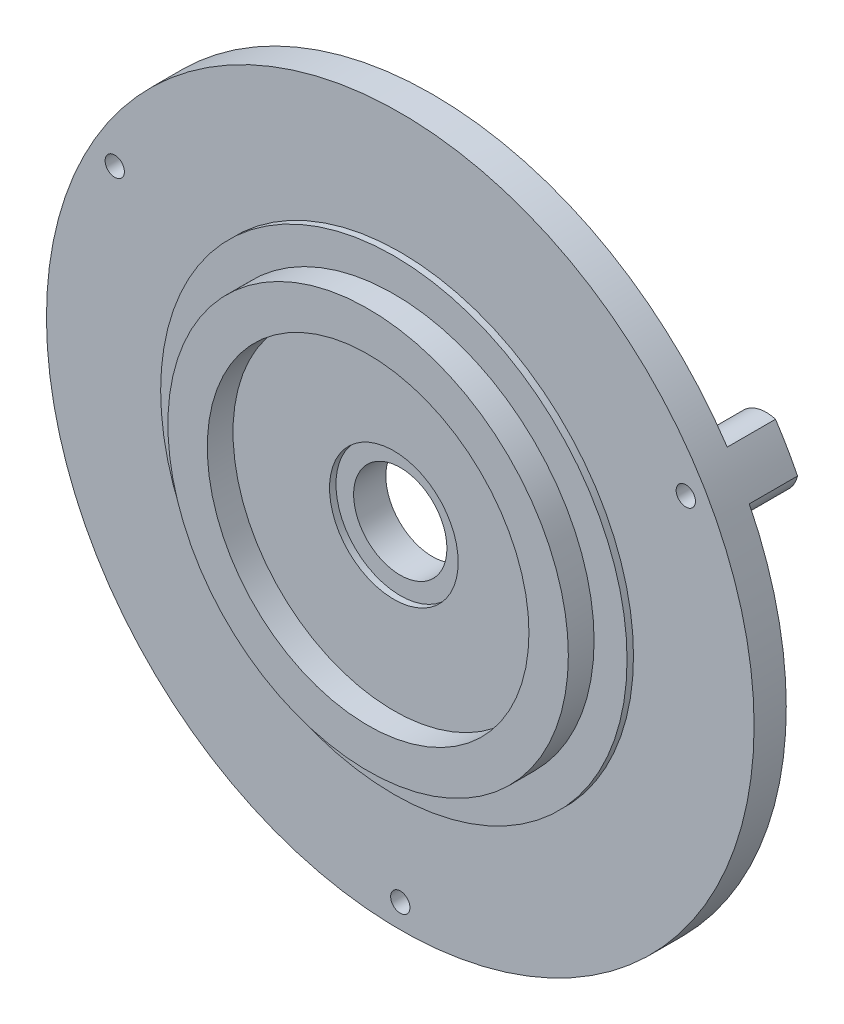
ISO-10303-21;
HEADER;
FILE_DESCRIPTION(('STEP AP214'),'2;1');
FILE_NAME('part.step','',(''),(''),'','','');
FILE_SCHEMA(('AUTOMOTIVE_DESIGN { 1 0 10303 214 1 1 1 1 }'));
ENDSEC;
DATA;
#1=APPLICATION_CONTEXT('core data for automotive mechanical design processes');
#2=APPLICATION_PROTOCOL_DEFINITION('international standard','automotive_design',2000,#1);
#3=PRODUCT_CONTEXT('',#1,'mechanical');
#4=PRODUCT('Part','Part','',(#3));
#5=PRODUCT_RELATED_PRODUCT_CATEGORY('part','',(#4));
#6=PRODUCT_DEFINITION_FORMATION('','',#4);
#7=PRODUCT_DEFINITION_CONTEXT('part definition',#1,'design');
#8=PRODUCT_DEFINITION('design','',#6,#7);
#9=PRODUCT_DEFINITION_SHAPE('','',#8);
#10=(LENGTH_UNIT() NAMED_UNIT(*) SI_UNIT(.MILLI.,.METRE.));
#11=(NAMED_UNIT(*) PLANE_ANGLE_UNIT() SI_UNIT($,.RADIAN.));
#12=(NAMED_UNIT(*) SI_UNIT($,.STERADIAN.) SOLID_ANGLE_UNIT());
#13=UNCERTAINTY_MEASURE_WITH_UNIT(LENGTH_MEASURE(1.E-05),#10,'distance_accuracy_value','');
#14=(GEOMETRIC_REPRESENTATION_CONTEXT(3) GLOBAL_UNCERTAINTY_ASSIGNED_CONTEXT((#13)) GLOBAL_UNIT_ASSIGNED_CONTEXT((#10,
#11,#12)) REPRESENTATION_CONTEXT('',''));
#15=CARTESIAN_POINT('',(0.,0.,0.));
#16=DIRECTION('',(0.,0.,1.));
#17=DIRECTION('',(1.,0.,0.));
#18=AXIS2_PLACEMENT_3D('',#15,#16,#17);
#19=CARTESIAN_POINT('',(0.,0.,2.));
#20=DIRECTION('',(0.,0.,1.));
#21=DIRECTION('',(1.,0.,0.));
#22=AXIS2_PLACEMENT_3D('',#19,#20,#21);
#23=PLANE('',#22);
#24=CARTESIAN_POINT('',(0.,0.,2.));
#25=DIRECTION('',(0.,0.,1.));
#26=DIRECTION('',(1.,0.,0.));
#27=AXIS2_PLACEMENT_3D('',#24,#25,#26);
#28=CIRCLE('',#27,2.9);
#29=CARTESIAN_POINT('',(2.9,0.,2.));
#30=VERTEX_POINT('',#29);
#31=EDGE_CURVE('E151',#30,#30,#28,.T.);
#32=ORIENTED_EDGE('',*,*,#31,.F.);
#33=EDGE_LOOP('',(#32));
#34=FACE_BOUND('',#33,.T.);
#35=CARTESIAN_POINT('',(0.,0.,2.));
#36=DIRECTION('',(0.,0.,1.));
#37=DIRECTION('',(1.,0.,0.));
#38=AXIS2_PLACEMENT_3D('',#35,#36,#37);
#39=CIRCLE('',#38,4.);
#40=CARTESIAN_POINT('',(4.,0.,2.));
#41=VERTEX_POINT('',#40);
#42=EDGE_CURVE('E48',#41,#41,#39,.F.);
#43=ORIENTED_EDGE('',*,*,#42,.F.);
#44=EDGE_LOOP('',(#43));
#45=FACE_BOUND('',#44,.T.);
#46=ADVANCED_FACE('F39',(#34,#45),#23,.T.);
#47=CARTESIAN_POINT('',(0.,0.,2.));
#48=DIRECTION('',(0.,0.,-1.));
#49=DIRECTION('',(-1.,0.,0.));
#50=AXIS2_PLACEMENT_3D('',#47,#48,#49);
#51=CYLINDRICAL_SURFACE('',#50,22.);
#52=CARTESIAN_POINT('',(0.,0.,2.));
#53=DIRECTION('',(0.,0.,1.));
#54=DIRECTION('',(1.,0.,0.));
#55=AXIS2_PLACEMENT_3D('',#52,#53,#54);
#56=CIRCLE('',#55,22.);
#57=CARTESIAN_POINT('',(22.,0.,2.));
#58=VERTEX_POINT('',#57);
#59=EDGE_CURVE('E165',#58,#58,#56,.T.);
#60=ORIENTED_EDGE('',*,*,#59,.F.);
#61=EDGE_LOOP('',(#60));
#62=FACE_BOUND('',#61,.T.);
#63=CARTESIAN_POINT('',(0.,0.,0.));
#64=DIRECTION('',(0.,0.,1.));
#65=DIRECTION('',(1.,0.,0.));
#66=AXIS2_PLACEMENT_3D('',#63,#64,#65);
#67=CIRCLE('',#66,22.);
#68=CARTESIAN_POINT('',(-19.7004715536397,9.79241648237204,0.));
#69=VERTEX_POINT('',#68);
#70=CARTESIAN_POINT('',(-1.36975433864802,-21.9573170731707,0.));
#71=VERTEX_POINT('',#70);
#72=EDGE_CURVE('E169',#69,#71,#67,.T.);
#73=ORIENTED_EDGE('',*,*,#72,.T.);
#74=DIRECTION('',(0.,0.,1.));
#75=VECTOR('',#74,1.);
#76=CARTESIAN_POINT('',(-1.36975433864802,-21.9573170731707,-3.));
#77=LINE('',#76,#75);
#78=CARTESIAN_POINT('',(-1.36975433864802,-21.9573170731707,-3.));
#79=VERTEX_POINT('',#78);
#80=EDGE_CURVE('E128',#79,#71,#77,.T.);
#81=ORIENTED_EDGE('',*,*,#80,.F.);
#82=CARTESIAN_POINT('',(0.,0.,-3.));
#83=DIRECTION('',(0.,0.,-1.));
#84=DIRECTION('',(-1.,0.,0.));
#85=AXIS2_PLACEMENT_3D('',#82,#83,#84);
#86=CIRCLE('',#85,22.);
#87=CARTESIAN_POINT('',(1.36975433864802,-21.9573170731707,-3.));
#88=VERTEX_POINT('',#87);
#89=EDGE_CURVE('E114',#88,#79,#86,.T.);
#90=ORIENTED_EDGE('',*,*,#89,.F.);
#91=DIRECTION('',(0.,0.,1.));
#92=VECTOR('',#91,1.);
#93=CARTESIAN_POINT('',(1.36975433864802,-21.9573170731707,-3.));
#94=LINE('',#93,#92);
#95=CARTESIAN_POINT('',(1.36975433864802,-21.9573170731707,0.));
#96=VERTEX_POINT('',#95);
#97=EDGE_CURVE('E124',#88,#96,#94,.T.);
#98=ORIENTED_EDGE('',*,*,#97,.T.);
#99=CARTESIAN_POINT('',(19.7004715536396,9.79241648237232,0.));
#100=VERTEX_POINT('',#99);
#101=EDGE_CURVE('E109',#96,#100,#67,.T.);
#102=ORIENTED_EDGE('',*,*,#101,.T.);
#103=DIRECTION('',(0.,0.,1.));
#104=VECTOR('',#103,1.);
#105=CARTESIAN_POINT('',(19.7004715536396,9.79241648237232,-3.));
#106=LINE('',#105,#104);
#107=CARTESIAN_POINT('',(19.7004715536396,9.79241648237232,-3.));
#108=VERTEX_POINT('',#107);
#109=EDGE_CURVE('E96',#108,#100,#106,.T.);
#110=ORIENTED_EDGE('',*,*,#109,.F.);
#111=CARTESIAN_POINT('',(0.,0.,-3.));
#112=DIRECTION('',(0.,0.,-1.));
#113=DIRECTION('',(-1.,0.,0.));
#114=AXIS2_PLACEMENT_3D('',#111,#112,#113);
#115=CIRCLE('',#114,22.);
#116=CARTESIAN_POINT('',(18.3307172149916,12.1649005907986,-3.));
#117=VERTEX_POINT('',#116);
#118=EDGE_CURVE('E102',#117,#108,#115,.T.);
#119=ORIENTED_EDGE('',*,*,#118,.F.);
#120=DIRECTION('',(0.,0.,1.));
#121=VECTOR('',#120,1.);
#122=CARTESIAN_POINT('',(18.3307172149916,12.1649005907986,-3.));
#123=LINE('',#122,#121);
#124=CARTESIAN_POINT('',(18.3307172149916,12.1649005907986,0.));
#125=VERTEX_POINT('',#124);
#126=EDGE_CURVE('E98',#117,#125,#123,.T.);
#127=ORIENTED_EDGE('',*,*,#126,.T.);
#128=CARTESIAN_POINT('',(-18.3307172149917,12.1649005907983,0.));
#129=VERTEX_POINT('',#128);
#130=EDGE_CURVE('E164',#125,#129,#67,.T.);
#131=ORIENTED_EDGE('',*,*,#130,.T.);
#132=DIRECTION('',(0.,0.,1.));
#133=VECTOR('',#132,1.);
#134=CARTESIAN_POINT('',(-18.3307172149917,12.1649005907983,-3.));
#135=LINE('',#134,#133);
#136=CARTESIAN_POINT('',(-18.3307172149917,12.1649005907983,-3.));
#137=VERTEX_POINT('',#136);
#138=EDGE_CURVE('E147',#137,#129,#135,.T.);
#139=ORIENTED_EDGE('',*,*,#138,.F.);
#140=CARTESIAN_POINT('',(0.,0.,-3.));
#141=DIRECTION('',(0.,0.,-1.));
#142=DIRECTION('',(-1.,0.,0.));
#143=AXIS2_PLACEMENT_3D('',#140,#141,#142);
#144=CIRCLE('',#143,22.);
#145=CARTESIAN_POINT('',(-19.7004715536397,9.79241648237204,-3.));
#146=VERTEX_POINT('',#145);
#147=EDGE_CURVE('E133',#146,#137,#144,.T.);
#148=ORIENTED_EDGE('',*,*,#147,.F.);
#149=DIRECTION('',(0.,0.,1.));
#150=VECTOR('',#149,1.);
#151=CARTESIAN_POINT('',(-19.7004715536397,9.79241648237204,-3.));
#152=LINE('',#151,#150);
#153=EDGE_CURVE('E140',#146,#69,#152,.T.);
#154=ORIENTED_EDGE('',*,*,#153,.T.);
#155=EDGE_LOOP('',(#73,#81,#90,#98,#102,#110,#119,#127,#131,#139,#148,#154));
#156=FACE_BOUND('',#155,.T.);
#157=ADVANCED_FACE('F41',(#62,#156),#51,.T.);
#158=CARTESIAN_POINT('',(0.,0.,2.));
#159=DIRECTION('',(0.,0.,1.));
#160=DIRECTION('',(1.,0.,0.));
#161=AXIS2_PLACEMENT_3D('',#158,#159,#160);
#162=CIRCLE('',#161,14.5);
#163=CARTESIAN_POINT('',(14.5,0.,2.));
#164=VERTEX_POINT('',#163);
#165=EDGE_CURVE('E200',#164,#164,#162,.T.);
#166=ORIENTED_EDGE('',*,*,#165,.F.);
#167=EDGE_LOOP('',(#166));
#168=FACE_BOUND('',#167,.T.);
#169=CARTESIAN_POINT('',(0.,-20.5,2.));
#170=DIRECTION('',(0.,0.,1.));
#171=DIRECTION('',(1.,0.,0.));
#172=AXIS2_PLACEMENT_3D('',#169,#170,#171);
#173=CIRCLE('',#172,0.6);
#174=CARTESIAN_POINT('',(0.6,-20.5,2.));
#175=VERTEX_POINT('',#174);
#176=EDGE_CURVE('E204',#175,#175,#173,.T.);
#177=ORIENTED_EDGE('',*,*,#176,.F.);
#178=EDGE_LOOP('',(#177));
#179=FACE_BOUND('',#178,.T.);
#180=CARTESIAN_POINT('',(17.7535207775809,10.2500000000001,2.));
#181=DIRECTION('',(0.,0.,1.));
#182=DIRECTION('',(1.,0.,0.));
#183=AXIS2_PLACEMENT_3D('',#180,#181,#182);
#184=CIRCLE('',#183,0.6);
#185=CARTESIAN_POINT('',(18.353520777581,10.2500000000001,2.));
#186=VERTEX_POINT('',#185);
#187=EDGE_CURVE('E208',#186,#186,#184,.T.);
#188=ORIENTED_EDGE('',*,*,#187,.F.);
#189=EDGE_LOOP('',(#188));
#190=FACE_BOUND('',#189,.T.);
#191=CARTESIAN_POINT('',(-17.7535207775811,10.2499999999998,2.));
#192=DIRECTION('',(0.,0.,1.));
#193=DIRECTION('',(1.,0.,0.));
#194=AXIS2_PLACEMENT_3D('',#191,#192,#193);
#195=CIRCLE('',#194,0.6);
#196=CARTESIAN_POINT('',(-17.1535207775811,10.2499999999998,2.));
#197=VERTEX_POINT('',#196);
#198=EDGE_CURVE('E212',#197,#197,#195,.T.);
#199=ORIENTED_EDGE('',*,*,#198,.F.);
#200=EDGE_LOOP('',(#199));
#201=FACE_BOUND('',#200,.T.);
#202=ORIENTED_EDGE('',*,*,#59,.T.);
#203=EDGE_LOOP('',(#202));
#204=FACE_BOUND('',#203,.T.);
#205=ADVANCED_FACE('F183',(#168,#179,#190,#201,#204),#23,.T.);
#206=CARTESIAN_POINT('',(0.,0.,0.));
#207=DIRECTION('',(0.,0.,1.));
#208=DIRECTION('',(1.,0.,0.));
#209=AXIS2_PLACEMENT_3D('',#206,#207,#208);
#210=PLANE('',#209);
#211=CARTESIAN_POINT('',(17.7535207775809,10.2500000000001,0.));
#212=DIRECTION('',(0.,0.,-1.));
#213=DIRECTION('',(-1.,0.,0.));
#214=AXIS2_PLACEMENT_3D('',#211,#212,#213);
#215=CIRCLE('',#214,1.99999999999999);
#216=EDGE_CURVE('E55',#100,#125,#215,.T.);
#217=ORIENTED_EDGE('',*,*,#216,.F.);
#218=ORIENTED_EDGE('',*,*,#101,.F.);
#219=CARTESIAN_POINT('',(0.,-20.5,0.));
#220=DIRECTION('',(0.,0.,-1.));
#221=DIRECTION('',(-1.,0.,0.));
#222=AXIS2_PLACEMENT_3D('',#219,#220,#221);
#223=CIRCLE('',#222,2.);
#224=EDGE_CURVE('E61',#71,#96,#223,.T.);
#225=ORIENTED_EDGE('',*,*,#224,.F.);
#226=ORIENTED_EDGE('',*,*,#72,.F.);
#227=CARTESIAN_POINT('',(-17.7535207775811,10.2499999999998,0.));
#228=DIRECTION('',(0.,0.,-1.));
#229=DIRECTION('',(-1.,0.,0.));
#230=AXIS2_PLACEMENT_3D('',#227,#228,#229);
#231=CIRCLE('',#230,2.);
#232=EDGE_CURVE('E132',#129,#69,#231,.T.);
#233=ORIENTED_EDGE('',*,*,#232,.F.);
#234=ORIENTED_EDGE('',*,*,#130,.F.);
#235=EDGE_LOOP('',(#217,#218,#225,#226,#233,#234));
#236=FACE_BOUND('',#235,.T.);
#237=CARTESIAN_POINT('',(0.,0.,0.));
#238=DIRECTION('',(0.,0.,1.));
#239=DIRECTION('',(1.,0.,0.));
#240=AXIS2_PLACEMENT_3D('',#237,#238,#239);
#241=CIRCLE('',#240,2.9);
#242=CARTESIAN_POINT('',(2.9,0.,0.));
#243=VERTEX_POINT('',#242);
#244=EDGE_CURVE('E155',#243,#243,#241,.T.);
#245=ORIENTED_EDGE('',*,*,#244,.T.);
#246=EDGE_LOOP('',(#245));
#247=FACE_BOUND('',#246,.T.);
#248=ADVANCED_FACE('F191',(#236,#247),#210,.F.);
#249=CARTESIAN_POINT('',(0.,0.,-9.));
#250=DIRECTION('',(0.,0.,1.));
#251=DIRECTION('',(1.,0.,0.));
#252=AXIS2_PLACEMENT_3D('',#249,#250,#251);
#253=CYLINDRICAL_SURFACE('',#252,2.9);
#254=ORIENTED_EDGE('',*,*,#31,.T.);
#255=EDGE_LOOP('',(#254));
#256=FACE_BOUND('',#255,.T.);
#257=ORIENTED_EDGE('',*,*,#244,.F.);
#258=EDGE_LOOP('',(#257));
#259=FACE_BOUND('',#258,.T.);
#260=ADVANCED_FACE('F196',(#256,#259),#253,.F.);
#261=CARTESIAN_POINT('',(-17.7535207775811,10.2499999999998,-3.));
#262=DIRECTION('',(0.,0.,1.));
#263=DIRECTION('',(1.,0.,0.));
#264=AXIS2_PLACEMENT_3D('',#261,#262,#263);
#265=CYLINDRICAL_SURFACE('',#264,2.);
#266=ORIENTED_EDGE('',*,*,#232,.T.);
#267=ORIENTED_EDGE('',*,*,#153,.F.);
#268=CARTESIAN_POINT('',(-17.7535207775811,10.2499999999998,-3.));
#269=DIRECTION('',(0.,0.,-1.));
#270=DIRECTION('',(-1.,0.,0.));
#271=AXIS2_PLACEMENT_3D('',#268,#269,#270);
#272=CIRCLE('',#271,2.);
#273=EDGE_CURVE('E137',#137,#146,#272,.T.);
#274=ORIENTED_EDGE('',*,*,#273,.F.);
#275=ORIENTED_EDGE('',*,*,#138,.T.);
#276=EDGE_LOOP('',(#266,#267,#274,#275));
#277=FACE_BOUND('',#276,.T.);
#278=ADVANCED_FACE('F276',(#277),#265,.T.);
#279=CARTESIAN_POINT('',(-8.87676038879054,5.12499999999992,-3.));
#280=DIRECTION('',(0.,0.,-1.));
#281=DIRECTION('',(-1.,0.,0.));
#282=AXIS2_PLACEMENT_3D('',#279,#280,#281);
#283=PLANE('',#282);
#284=CARTESIAN_POINT('',(-17.7535207775811,10.2499999999998,-3.));
#285=DIRECTION('',(0.,0.,-1.));
#286=DIRECTION('',(-1.,0.,0.));
#287=AXIS2_PLACEMENT_3D('',#284,#285,#286);
#288=CIRCLE('',#287,0.6);
#289=CARTESIAN_POINT('',(-18.3535207775811,10.2499999999998,-3.));
#290=VERTEX_POINT('',#289);
#291=EDGE_CURVE('E224',#290,#290,#288,.T.);
#292=ORIENTED_EDGE('',*,*,#291,.F.);
#293=EDGE_LOOP('',(#292));
#294=FACE_BOUND('',#293,.T.);
#295=ORIENTED_EDGE('',*,*,#147,.T.);
#296=ORIENTED_EDGE('',*,*,#273,.T.);
#297=EDGE_LOOP('',(#295,#296));
#298=FACE_BOUND('',#297,.T.);
#299=ADVANCED_FACE('F280',(#294,#298),#283,.T.);
#300=CARTESIAN_POINT('',(0.,-20.5,-3.));
#301=DIRECTION('',(0.,0.,1.));
#302=DIRECTION('',(1.,0.,0.));
#303=AXIS2_PLACEMENT_3D('',#300,#301,#302);
#304=CYLINDRICAL_SURFACE('',#303,2.);
#305=ORIENTED_EDGE('',*,*,#224,.T.);
#306=ORIENTED_EDGE('',*,*,#97,.F.);
#307=CARTESIAN_POINT('',(0.,-20.5,-3.));
#308=DIRECTION('',(0.,0.,-1.));
#309=DIRECTION('',(-1.,0.,0.));
#310=AXIS2_PLACEMENT_3D('',#307,#308,#309);
#311=CIRCLE('',#310,2.);
#312=EDGE_CURVE('E122',#79,#88,#311,.T.);
#313=ORIENTED_EDGE('',*,*,#312,.F.);
#314=ORIENTED_EDGE('',*,*,#80,.T.);
#315=EDGE_LOOP('',(#305,#306,#313,#314));
#316=FACE_BOUND('',#315,.T.);
#317=ADVANCED_FACE('F284',(#316),#304,.T.);
#318=CARTESIAN_POINT('',(0.,-10.25,-3.));
#319=DIRECTION('',(0.,0.,-1.));
#320=DIRECTION('',(-1.,0.,0.));
#321=AXIS2_PLACEMENT_3D('',#318,#319,#320);
#322=PLANE('',#321);
#323=CARTESIAN_POINT('',(0.,-20.5,-3.));
#324=DIRECTION('',(0.,0.,-1.));
#325=DIRECTION('',(-1.,0.,0.));
#326=AXIS2_PLACEMENT_3D('',#323,#324,#325);
#327=CIRCLE('',#326,0.6);
#328=CARTESIAN_POINT('',(-0.6,-20.5,-3.));
#329=VERTEX_POINT('',#328);
#330=EDGE_CURVE('E223',#329,#329,#327,.T.);
#331=ORIENTED_EDGE('',*,*,#330,.F.);
#332=EDGE_LOOP('',(#331));
#333=FACE_BOUND('',#332,.T.);
#334=ORIENTED_EDGE('',*,*,#89,.T.);
#335=ORIENTED_EDGE('',*,*,#312,.T.);
#336=EDGE_LOOP('',(#334,#335));
#337=FACE_BOUND('',#336,.T.);
#338=ADVANCED_FACE('F288',(#333,#337),#322,.T.);
#339=CARTESIAN_POINT('',(17.7535207775809,10.2500000000001,-3.));
#340=DIRECTION('',(0.,0.,1.));
#341=DIRECTION('',(1.,0.,0.));
#342=AXIS2_PLACEMENT_3D('',#339,#340,#341);
#343=CYLINDRICAL_SURFACE('',#342,1.99999999999999);
#344=ORIENTED_EDGE('',*,*,#216,.T.);
#345=ORIENTED_EDGE('',*,*,#126,.F.);
#346=CARTESIAN_POINT('',(17.7535207775809,10.2500000000001,-3.));
#347=DIRECTION('',(0.,0.,-1.));
#348=DIRECTION('',(-1.,0.,0.));
#349=AXIS2_PLACEMENT_3D('',#346,#347,#348);
#350=CIRCLE('',#349,1.99999999999999);
#351=EDGE_CURVE('E92',#108,#117,#350,.T.);
#352=ORIENTED_EDGE('',*,*,#351,.F.);
#353=ORIENTED_EDGE('',*,*,#109,.T.);
#354=EDGE_LOOP('',(#344,#345,#352,#353));
#355=FACE_BOUND('',#354,.T.);
#356=ADVANCED_FACE('F94',(#355),#343,.T.);
#357=CARTESIAN_POINT('',(8.87676038879047,5.12500000000004,-3.));
#358=DIRECTION('',(0.,0.,-1.));
#359=DIRECTION('',(-1.,0.,0.));
#360=AXIS2_PLACEMENT_3D('',#357,#358,#359);
#361=PLANE('',#360);
#362=CARTESIAN_POINT('',(17.7535207775809,10.2500000000001,-3.));
#363=DIRECTION('',(0.,0.,-1.));
#364=DIRECTION('',(-1.,0.,0.));
#365=AXIS2_PLACEMENT_3D('',#362,#363,#364);
#366=CIRCLE('',#365,0.6);
#367=CARTESIAN_POINT('',(17.153520777581,10.2500000000001,-3.));
#368=VERTEX_POINT('',#367);
#369=EDGE_CURVE('E228',#368,#368,#366,.T.);
#370=ORIENTED_EDGE('',*,*,#369,.F.);
#371=EDGE_LOOP('',(#370));
#372=FACE_BOUND('',#371,.T.);
#373=ORIENTED_EDGE('',*,*,#118,.T.);
#374=ORIENTED_EDGE('',*,*,#351,.T.);
#375=EDGE_LOOP('',(#373,#374));
#376=FACE_BOUND('',#375,.T.);
#377=ADVANCED_FACE('F104',(#372,#376),#361,.T.);
#378=CARTESIAN_POINT('',(17.7535207775809,10.2500000000001,13.));
#379=DIRECTION('',(0.,0.,-1.));
#380=DIRECTION('',(-1.,0.,0.));
#381=AXIS2_PLACEMENT_3D('',#378,#379,#380);
#382=CYLINDRICAL_SURFACE('',#381,0.6);
#383=ORIENTED_EDGE('',*,*,#187,.T.);
#384=EDGE_LOOP('',(#383));
#385=FACE_BOUND('',#384,.T.);
#386=ORIENTED_EDGE('',*,*,#369,.T.);
#387=EDGE_LOOP('',(#386));
#388=FACE_BOUND('',#387,.T.);
#389=ADVANCED_FACE('F297',(#385,#388),#382,.F.);
#390=CARTESIAN_POINT('',(0.,-20.5,13.));
#391=DIRECTION('',(0.,0.,-1.));
#392=DIRECTION('',(-1.,0.,0.));
#393=AXIS2_PLACEMENT_3D('',#390,#391,#392);
#394=CYLINDRICAL_SURFACE('',#393,0.6);
#395=ORIENTED_EDGE('',*,*,#176,.T.);
#396=EDGE_LOOP('',(#395));
#397=FACE_BOUND('',#396,.T.);
#398=ORIENTED_EDGE('',*,*,#330,.T.);
#399=EDGE_LOOP('',(#398));
#400=FACE_BOUND('',#399,.T.);
#401=ADVANCED_FACE('F302',(#397,#400),#394,.F.);
#402=CARTESIAN_POINT('',(-17.7535207775811,10.2499999999998,13.));
#403=DIRECTION('',(0.,0.,-1.));
#404=DIRECTION('',(-1.,0.,0.));
#405=AXIS2_PLACEMENT_3D('',#402,#403,#404);
#406=CYLINDRICAL_SURFACE('',#405,0.6);
#407=ORIENTED_EDGE('',*,*,#198,.T.);
#408=EDGE_LOOP('',(#407));
#409=FACE_BOUND('',#408,.T.);
#410=ORIENTED_EDGE('',*,*,#291,.T.);
#411=EDGE_LOOP('',(#410));
#412=FACE_BOUND('',#411,.T.);
#413=ADVANCED_FACE('F299',(#409,#412),#406,.F.);
#414=CARTESIAN_POINT('',(0.,0.,2.4));
#415=DIRECTION('',(0.,0.,-1.));
#416=DIRECTION('',(-1.,0.,0.));
#417=AXIS2_PLACEMENT_3D('',#414,#415,#416);
#418=CYLINDRICAL_SURFACE('',#417,4.);
#419=CARTESIAN_POINT('',(0.,0.,2.4));
#420=DIRECTION('',(0.,0.,1.));
#421=DIRECTION('',(1.,0.,0.));
#422=AXIS2_PLACEMENT_3D('',#419,#420,#421);
#423=CIRCLE('',#422,4.);
#424=CARTESIAN_POINT('',(4.,0.,2.4));
#425=VERTEX_POINT('',#424);
#426=EDGE_CURVE('E242',#425,#425,#423,.T.);
#427=ORIENTED_EDGE('',*,*,#426,.T.);
#428=EDGE_LOOP('',(#427));
#429=FACE_BOUND('',#428,.T.);
#430=ORIENTED_EDGE('',*,*,#42,.T.);
#431=EDGE_LOOP('',(#430));
#432=FACE_BOUND('',#431,.T.);
#433=ADVANCED_FACE('F178',(#429,#432),#418,.F.);
#434=CARTESIAN_POINT('',(0.,0.,2.4));
#435=DIRECTION('',(0.,0.,1.));
#436=DIRECTION('',(1.,0.,0.));
#437=AXIS2_PLACEMENT_3D('',#434,#435,#436);
#438=PLANE('',#437);
#439=ORIENTED_EDGE('',*,*,#426,.F.);
#440=EDGE_LOOP('',(#439));
#441=FACE_BOUND('',#440,.T.);
#442=CARTESIAN_POINT('',(0.,0.,2.4));
#443=DIRECTION('',(0.,0.,1.));
#444=DIRECTION('',(1.,0.,0.));
#445=AXIS2_PLACEMENT_3D('',#442,#443,#444);
#446=CIRCLE('',#445,10.);
#447=CARTESIAN_POINT('',(10.,0.,2.4));
#448=VERTEX_POINT('',#447);
#449=EDGE_CURVE('E11',#448,#448,#446,.T.);
#450=ORIENTED_EDGE('',*,*,#449,.T.);
#451=EDGE_LOOP('',(#450));
#452=FACE_BOUND('',#451,.T.);
#453=ADVANCED_FACE('F251',(#441,#452),#438,.T.);
#454=CARTESIAN_POINT('',(0.,0.,4.));
#455=DIRECTION('',(0.,0.,-1.));
#456=DIRECTION('',(-1.,0.,0.));
#457=AXIS2_PLACEMENT_3D('',#454,#455,#456);
#458=CYLINDRICAL_SURFACE('',#457,12.45);
#459=CARTESIAN_POINT('',(0.,0.,2.4));
#460=DIRECTION('',(0.,0.,1.));
#461=DIRECTION('',(1.,0.,0.));
#462=AXIS2_PLACEMENT_3D('',#459,#460,#461);
#463=CIRCLE('',#462,12.45);
#464=CARTESIAN_POINT('',(12.45,0.,2.4));
#465=VERTEX_POINT('',#464);
#466=EDGE_CURVE('E229',#465,#465,#463,.T.);
#467=ORIENTED_EDGE('',*,*,#466,.T.);
#468=EDGE_LOOP('',(#467));
#469=FACE_BOUND('',#468,.T.);
#470=CARTESIAN_POINT('',(0.,0.,4.));
#471=DIRECTION('',(0.,0.,1.));
#472=DIRECTION('',(1.,0.,0.));
#473=AXIS2_PLACEMENT_3D('',#470,#471,#472);
#474=CIRCLE('',#473,12.45);
#475=CARTESIAN_POINT('',(12.45,0.,4.));
#476=VERTEX_POINT('',#475);
#477=EDGE_CURVE('E160',#476,#476,#474,.T.);
#478=ORIENTED_EDGE('',*,*,#477,.F.);
#479=EDGE_LOOP('',(#478));
#480=FACE_BOUND('',#479,.T.);
#481=ADVANCED_FACE('F254',(#469,#480),#458,.T.);
#482=CARTESIAN_POINT('',(0.,0.,4.));
#483=DIRECTION('',(0.,0.,1.));
#484=DIRECTION('',(1.,0.,0.));
#485=AXIS2_PLACEMENT_3D('',#482,#483,#484);
#486=PLANE('',#485);
#487=ORIENTED_EDGE('',*,*,#477,.T.);
#488=EDGE_LOOP('',(#487));
#489=FACE_BOUND('',#488,.T.);
#490=CARTESIAN_POINT('',(0.,0.,4.));
#491=DIRECTION('',(0.,0.,1.));
#492=DIRECTION('',(1.,0.,0.));
#493=AXIS2_PLACEMENT_3D('',#490,#491,#492);
#494=CIRCLE('',#493,10.);
#495=CARTESIAN_POINT('',(10.,0.,4.));
#496=VERTEX_POINT('',#495);
#497=EDGE_CURVE('E156',#496,#496,#494,.T.);
#498=ORIENTED_EDGE('',*,*,#497,.F.);
#499=EDGE_LOOP('',(#498));
#500=FACE_BOUND('',#499,.T.);
#501=ADVANCED_FACE('F262',(#489,#500),#486,.T.);
#502=CARTESIAN_POINT('',(0.,0.,4.));
#503=DIRECTION('',(0.,0.,-1.));
#504=DIRECTION('',(-1.,0.,0.));
#505=AXIS2_PLACEMENT_3D('',#502,#503,#504);
#506=CYLINDRICAL_SURFACE('',#505,10.);
#507=ORIENTED_EDGE('',*,*,#449,.F.);
#508=EDGE_LOOP('',(#507));
#509=FACE_BOUND('',#508,.T.);
#510=ORIENTED_EDGE('',*,*,#497,.T.);
#511=EDGE_LOOP('',(#510));
#512=FACE_BOUND('',#511,.T.);
#513=ADVANCED_FACE('F259',(#509,#512),#506,.F.);
#514=ORIENTED_EDGE('',*,*,#466,.F.);
#515=EDGE_LOOP('',(#514));
#516=FACE_BOUND('',#515,.T.);
#517=CARTESIAN_POINT('',(0.,0.,2.4));
#518=DIRECTION('',(0.,0.,1.));
#519=DIRECTION('',(1.,0.,0.));
#520=AXIS2_PLACEMENT_3D('',#517,#518,#519);
#521=CIRCLE('',#520,14.5);
#522=CARTESIAN_POINT('',(14.5,0.,2.4));
#523=VERTEX_POINT('',#522);
#524=EDGE_CURVE('E239',#523,#523,#521,.T.);
#525=ORIENTED_EDGE('',*,*,#524,.T.);
#526=EDGE_LOOP('',(#525));
#527=FACE_BOUND('',#526,.T.);
#528=ADVANCED_FACE('F256',(#516,#527),#438,.T.);
#529=CARTESIAN_POINT('',(0.,0.,2.4));
#530=DIRECTION('',(0.,0.,-1.));
#531=DIRECTION('',(-1.,0.,0.));
#532=AXIS2_PLACEMENT_3D('',#529,#530,#531);
#533=CYLINDRICAL_SURFACE('',#532,14.5);
#534=ORIENTED_EDGE('',*,*,#524,.F.);
#535=EDGE_LOOP('',(#534));
#536=FACE_BOUND('',#535,.T.);
#537=ORIENTED_EDGE('',*,*,#165,.T.);
#538=EDGE_LOOP('',(#537));
#539=FACE_BOUND('',#538,.T.);
#540=ADVANCED_FACE('F309',(#536,#539),#533,.T.);
#541=CLOSED_SHELL('',(#46,#157,#205,#248,#260,#278,#299,#317,#338,#356,#377,#389,#401,#413,#433,
#453,#481,#501,#513,#528,#540));
#542=MANIFOLD_SOLID_BREP('B2',#541);
#543=ADVANCED_BREP_SHAPE_REPRESENTATION('',(#18,#542),#14);
#544=SHAPE_DEFINITION_REPRESENTATION(#9,#543);
ENDSEC;
END-ISO-10303-21;
